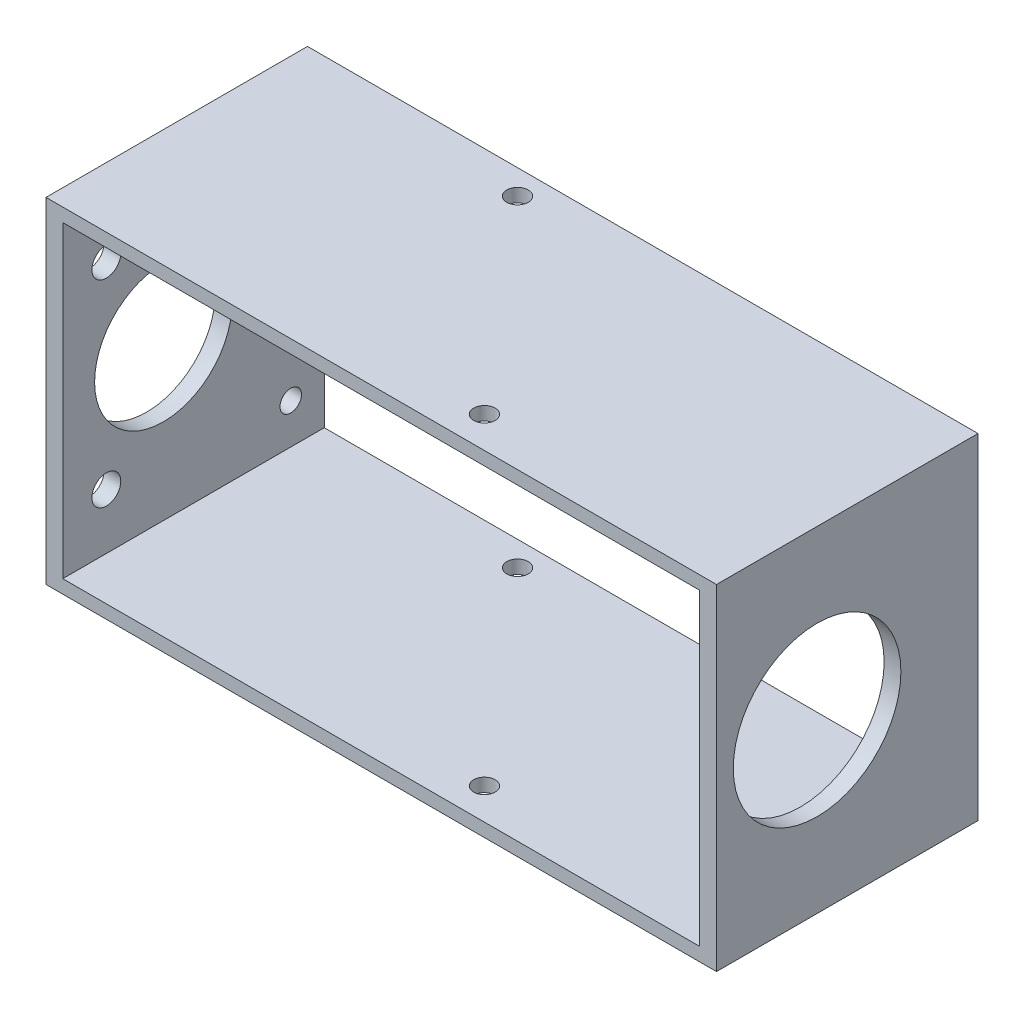
ISO-10303-21;
HEADER;
FILE_DESCRIPTION(('STEP AP214'),'2;1');
FILE_NAME('part.step','',(''),(''),'','','');
FILE_SCHEMA(('AUTOMOTIVE_DESIGN { 1 0 10303 214 1 1 1 1 }'));
ENDSEC;
DATA;
#1=APPLICATION_CONTEXT('core data for automotive mechanical design processes');
#2=APPLICATION_PROTOCOL_DEFINITION('international standard','automotive_design',2000,#1);
#3=PRODUCT_CONTEXT('',#1,'mechanical');
#4=PRODUCT('Part','Part','',(#3));
#5=PRODUCT_RELATED_PRODUCT_CATEGORY('part','',(#4));
#6=PRODUCT_DEFINITION_FORMATION('','',#4);
#7=PRODUCT_DEFINITION_CONTEXT('part definition',#1,'design');
#8=PRODUCT_DEFINITION('design','',#6,#7);
#9=PRODUCT_DEFINITION_SHAPE('','',#8);
#10=(LENGTH_UNIT() NAMED_UNIT(*) SI_UNIT(.MILLI.,.METRE.));
#11=(NAMED_UNIT(*) PLANE_ANGLE_UNIT() SI_UNIT($,.RADIAN.));
#12=(NAMED_UNIT(*) SI_UNIT($,.STERADIAN.) SOLID_ANGLE_UNIT());
#13=UNCERTAINTY_MEASURE_WITH_UNIT(LENGTH_MEASURE(1.E-05),#10,'distance_accuracy_value','');
#14=(GEOMETRIC_REPRESENTATION_CONTEXT(3) GLOBAL_UNCERTAINTY_ASSIGNED_CONTEXT((#13)) GLOBAL_UNIT_ASSIGNED_CONTEXT((#10,
#11,#12)) REPRESENTATION_CONTEXT('',''));
#15=CARTESIAN_POINT('',(0.,0.,0.));
#16=DIRECTION('',(0.,0.,1.));
#17=DIRECTION('',(1.,0.,0.));
#18=AXIS2_PLACEMENT_3D('',#15,#16,#17);
#19=CARTESIAN_POINT('',(0.,0.,19.5));
#20=DIRECTION('',(0.,0.,-1.));
#21=DIRECTION('',(-1.,0.,0.));
#22=AXIS2_PLACEMENT_3D('',#19,#20,#21);
#23=PLANE('',#22);
#24=DIRECTION('',(0.,1.,0.));
#25=VECTOR('',#24,1.);
#26=CARTESIAN_POINT('',(50.,-25.,19.5));
#27=LINE('',#26,#25);
#28=CARTESIAN_POINT('',(50.,-25.,19.5));
#29=VERTEX_POINT('',#28);
#30=CARTESIAN_POINT('',(50.,25.,19.5));
#31=VERTEX_POINT('',#30);
#32=EDGE_CURVE('E138',#29,#31,#27,.T.);
#33=ORIENTED_EDGE('',*,*,#32,.T.);
#34=DIRECTION('',(-1.,0.,0.));
#35=VECTOR('',#34,1.);
#36=CARTESIAN_POINT('',(-50.,25.,19.5));
#37=LINE('',#36,#35);
#38=CARTESIAN_POINT('',(-50.,25.,19.5));
#39=VERTEX_POINT('',#38);
#40=EDGE_CURVE('E141',#31,#39,#37,.T.);
#41=ORIENTED_EDGE('',*,*,#40,.T.);
#42=DIRECTION('',(0.,-1.,0.));
#43=VECTOR('',#42,1.);
#44=CARTESIAN_POINT('',(-50.,-25.,19.5));
#45=LINE('',#44,#43);
#46=CARTESIAN_POINT('',(-50.,-25.,19.5));
#47=VERTEX_POINT('',#46);
#48=EDGE_CURVE('E144',#39,#47,#45,.T.);
#49=ORIENTED_EDGE('',*,*,#48,.T.);
#50=DIRECTION('',(1.,0.,0.));
#51=VECTOR('',#50,1.);
#52=CARTESIAN_POINT('',(-50.,-25.,19.5));
#53=LINE('',#52,#51);
#54=EDGE_CURVE('E146',#47,#29,#53,.T.);
#55=ORIENTED_EDGE('',*,*,#54,.T.);
#56=EDGE_LOOP('',(#33,#41,#49,#55));
#57=FACE_BOUND('',#56,.T.);
#58=DIRECTION('',(0.,1.,0.));
#59=VECTOR('',#58,1.);
#60=CARTESIAN_POINT('',(47.5,-23.,19.5));
#61=LINE('',#60,#59);
#62=CARTESIAN_POINT('',(47.5,-23.,19.5));
#63=VERTEX_POINT('',#62);
#64=CARTESIAN_POINT('',(47.5,23.,19.5));
#65=VERTEX_POINT('',#64);
#66=EDGE_CURVE('E100',#63,#65,#61,.T.);
#67=ORIENTED_EDGE('',*,*,#66,.F.);
#68=DIRECTION('',(1.,0.,0.));
#69=VECTOR('',#68,1.);
#70=CARTESIAN_POINT('',(-47.5,-23.,19.5));
#71=LINE('',#70,#69);
#72=CARTESIAN_POINT('',(-47.5,-23.,19.5));
#73=VERTEX_POINT('',#72);
#74=EDGE_CURVE('E122',#73,#63,#71,.T.);
#75=ORIENTED_EDGE('',*,*,#74,.F.);
#76=DIRECTION('',(0.,-1.,0.));
#77=VECTOR('',#76,1.);
#78=CARTESIAN_POINT('',(-47.5,-23.,19.5));
#79=LINE('',#78,#77);
#80=CARTESIAN_POINT('',(-47.5,23.,19.5));
#81=VERTEX_POINT('',#80);
#82=EDGE_CURVE('E120',#81,#73,#79,.T.);
#83=ORIENTED_EDGE('',*,*,#82,.F.);
#84=DIRECTION('',(-1.,0.,0.));
#85=VECTOR('',#84,1.);
#86=CARTESIAN_POINT('',(-47.5,23.,19.5));
#87=LINE('',#86,#85);
#88=EDGE_CURVE('E108',#65,#81,#87,.T.);
#89=ORIENTED_EDGE('',*,*,#88,.F.);
#90=EDGE_LOOP('',(#67,#75,#83,#89));
#91=FACE_BOUND('',#90,.T.);
#92=ADVANCED_FACE('F33',(#57,#91),#23,.F.);
#93=CARTESIAN_POINT('',(0.,0.,-19.5));
#94=DIRECTION('',(0.,0.,-1.));
#95=DIRECTION('',(-1.,0.,0.));
#96=AXIS2_PLACEMENT_3D('',#93,#94,#95);
#97=PLANE('',#96);
#98=DIRECTION('',(0.,1.,0.));
#99=VECTOR('',#98,1.);
#100=CARTESIAN_POINT('',(50.,-25.,-19.5));
#101=LINE('',#100,#99);
#102=CARTESIAN_POINT('',(50.,-25.,-19.5));
#103=VERTEX_POINT('',#102);
#104=CARTESIAN_POINT('',(50.,25.,-19.5));
#105=VERTEX_POINT('',#104);
#106=EDGE_CURVE('E116',#103,#105,#101,.T.);
#107=ORIENTED_EDGE('',*,*,#106,.F.);
#108=DIRECTION('',(1.,0.,0.));
#109=VECTOR('',#108,1.);
#110=CARTESIAN_POINT('',(-50.,-25.,-19.5));
#111=LINE('',#110,#109);
#112=CARTESIAN_POINT('',(-50.,-25.,-19.5));
#113=VERTEX_POINT('',#112);
#114=EDGE_CURVE('E142',#113,#103,#111,.T.);
#115=ORIENTED_EDGE('',*,*,#114,.F.);
#116=DIRECTION('',(0.,-1.,0.));
#117=VECTOR('',#116,1.);
#118=CARTESIAN_POINT('',(-50.,-25.,-19.5));
#119=LINE('',#118,#117);
#120=CARTESIAN_POINT('',(-50.,25.,-19.5));
#121=VERTEX_POINT('',#120);
#122=EDGE_CURVE('E153',#121,#113,#119,.T.);
#123=ORIENTED_EDGE('',*,*,#122,.F.);
#124=DIRECTION('',(-1.,0.,0.));
#125=VECTOR('',#124,1.);
#126=CARTESIAN_POINT('',(-50.,25.,-19.5));
#127=LINE('',#126,#125);
#128=EDGE_CURVE('E151',#105,#121,#127,.T.);
#129=ORIENTED_EDGE('',*,*,#128,.F.);
#130=EDGE_LOOP('',(#107,#115,#123,#129));
#131=FACE_BOUND('',#130,.T.);
#132=DIRECTION('',(1.,0.,0.));
#133=VECTOR('',#132,1.);
#134=CARTESIAN_POINT('',(-47.5,-23.,-19.5));
#135=LINE('',#134,#133);
#136=CARTESIAN_POINT('',(-47.5,-23.,-19.5));
#137=VERTEX_POINT('',#136);
#138=CARTESIAN_POINT('',(47.5,-23.,-19.5));
#139=VERTEX_POINT('',#138);
#140=EDGE_CURVE('E109',#137,#139,#135,.T.);
#141=ORIENTED_EDGE('',*,*,#140,.T.);
#142=DIRECTION('',(0.,1.,0.));
#143=VECTOR('',#142,1.);
#144=CARTESIAN_POINT('',(47.5,-23.,-19.5));
#145=LINE('',#144,#143);
#146=CARTESIAN_POINT('',(47.5,23.,-19.5));
#147=VERTEX_POINT('',#146);
#148=EDGE_CURVE('E58',#139,#147,#145,.T.);
#149=ORIENTED_EDGE('',*,*,#148,.T.);
#150=DIRECTION('',(-1.,0.,0.));
#151=VECTOR('',#150,1.);
#152=CARTESIAN_POINT('',(-47.5,23.,-19.5));
#153=LINE('',#152,#151);
#154=CARTESIAN_POINT('',(-47.5,23.,-19.5));
#155=VERTEX_POINT('',#154);
#156=EDGE_CURVE('E115',#147,#155,#153,.T.);
#157=ORIENTED_EDGE('',*,*,#156,.T.);
#158=DIRECTION('',(0.,-1.,0.));
#159=VECTOR('',#158,1.);
#160=CARTESIAN_POINT('',(-47.5,-23.,-19.5));
#161=LINE('',#160,#159);
#162=EDGE_CURVE('E130',#155,#137,#161,.T.);
#163=ORIENTED_EDGE('',*,*,#162,.T.);
#164=EDGE_LOOP('',(#141,#149,#157,#163));
#165=FACE_BOUND('',#164,.T.);
#166=ADVANCED_FACE('F204',(#131,#165),#97,.T.);
#167=CARTESIAN_POINT('',(50.,-25.,19.5));
#168=DIRECTION('',(-1.,0.,0.));
#169=DIRECTION('',(0.,0.,1.));
#170=AXIS2_PLACEMENT_3D('',#167,#168,#169);
#171=PLANE('',#170);
#172=CARTESIAN_POINT('',(50.,0.,4.5));
#173=DIRECTION('',(1.,0.,0.));
#174=DIRECTION('',(0.,0.,-1.));
#175=AXIS2_PLACEMENT_3D('',#172,#173,#174);
#176=CIRCLE('',#175,12.5);
#177=CARTESIAN_POINT('',(50.,0.,-8.));
#178=VERTEX_POINT('',#177);
#179=EDGE_CURVE('E398',#178,#178,#176,.T.);
#180=ORIENTED_EDGE('',*,*,#179,.F.);
#181=EDGE_LOOP('',(#180));
#182=FACE_BOUND('',#181,.T.);
#183=ORIENTED_EDGE('',*,*,#106,.T.);
#184=DIRECTION('',(0.,0.,-1.));
#185=VECTOR('',#184,1.);
#186=CARTESIAN_POINT('',(50.,25.,19.5));
#187=LINE('',#186,#185);
#188=EDGE_CURVE('E11',#31,#105,#187,.T.);
#189=ORIENTED_EDGE('',*,*,#188,.F.);
#190=ORIENTED_EDGE('',*,*,#32,.F.);
#191=DIRECTION('',(0.,0.,-1.));
#192=VECTOR('',#191,1.);
#193=CARTESIAN_POINT('',(50.,-25.,19.5));
#194=LINE('',#193,#192);
#195=EDGE_CURVE('E148',#29,#103,#194,.T.);
#196=ORIENTED_EDGE('',*,*,#195,.T.);
#197=EDGE_LOOP('',(#183,#189,#190,#196));
#198=FACE_BOUND('',#197,.T.);
#199=ADVANCED_FACE('F35',(#182,#198),#171,.F.);
#200=CARTESIAN_POINT('',(-50.,25.,19.5));
#201=DIRECTION('',(0.,-1.,0.));
#202=DIRECTION('',(0.,0.,-1.));
#203=AXIS2_PLACEMENT_3D('',#200,#201,#202);
#204=PLANE('',#203);
#205=CARTESIAN_POINT('',(10.7115043874615,25.,14.8208888623796));
#206=DIRECTION('',(0.,1.,0.));
#207=DIRECTION('',(0.,0.,1.));
#208=AXIS2_PLACEMENT_3D('',#205,#206,#207);
#209=CIRCLE('',#208,1.6);
#210=CARTESIAN_POINT('',(10.7115043874615,25.,16.4208888623796));
#211=VERTEX_POINT('',#210);
#212=EDGE_CURVE('E171',#211,#211,#209,.T.);
#213=ORIENTED_EDGE('',*,*,#212,.F.);
#214=EDGE_LOOP('',(#213));
#215=FACE_BOUND('',#214,.T.);
#216=CARTESIAN_POINT('',(-15.,25.,-15.8208888623796));
#217=DIRECTION('',(0.,1.,0.));
#218=DIRECTION('',(0.,0.,1.));
#219=AXIS2_PLACEMENT_3D('',#216,#217,#218);
#220=CIRCLE('',#219,1.6);
#221=CARTESIAN_POINT('',(-15.,25.,-14.2208888623796));
#222=VERTEX_POINT('',#221);
#223=EDGE_CURVE('E184',#222,#222,#220,.T.);
#224=ORIENTED_EDGE('',*,*,#223,.F.);
#225=EDGE_LOOP('',(#224));
#226=FACE_BOUND('',#225,.T.);
#227=ORIENTED_EDGE('',*,*,#128,.T.);
#228=DIRECTION('',(0.,0.,-1.));
#229=VECTOR('',#228,1.);
#230=CARTESIAN_POINT('',(-50.,25.,19.5));
#231=LINE('',#230,#229);
#232=EDGE_CURVE('E42',#39,#121,#231,.T.);
#233=ORIENTED_EDGE('',*,*,#232,.F.);
#234=ORIENTED_EDGE('',*,*,#40,.F.);
#235=ORIENTED_EDGE('',*,*,#188,.T.);
#236=EDGE_LOOP('',(#227,#233,#234,#235));
#237=FACE_BOUND('',#236,.T.);
#238=ADVANCED_FACE('F231',(#215,#226,#237),#204,.F.);
#239=CARTESIAN_POINT('',(-50.,-25.,19.5));
#240=DIRECTION('',(1.,0.,0.));
#241=DIRECTION('',(0.,0.,-1.));
#242=AXIS2_PLACEMENT_3D('',#239,#240,#241);
#243=PLANE('',#242);
#244=CARTESIAN_POINT('',(-50.,0.,4.5));
#245=DIRECTION('',(-1.,0.,0.));
#246=DIRECTION('',(0.,0.,1.));
#247=AXIS2_PLACEMENT_3D('',#244,#245,#246);
#248=CIRCLE('',#247,10.25);
#249=CARTESIAN_POINT('',(-50.,0.,14.75));
#250=VERTEX_POINT('',#249);
#251=EDGE_CURVE('E409',#250,#250,#248,.T.);
#252=ORIENTED_EDGE('',*,*,#251,.F.);
#253=EDGE_LOOP('',(#252));
#254=FACE_BOUND('',#253,.T.);
#255=CARTESIAN_POINT('',(-50.,14.7224318643355,13.));
#256=DIRECTION('',(-1.,0.,0.));
#257=DIRECTION('',(0.,0.,1.));
#258=AXIS2_PLACEMENT_3D('',#255,#256,#257);
#259=CIRCLE('',#258,2.15);
#260=CARTESIAN_POINT('',(-50.,14.7224318643355,15.15));
#261=VERTEX_POINT('',#260);
#262=EDGE_CURVE('E414',#261,#261,#259,.T.);
#263=ORIENTED_EDGE('',*,*,#262,.F.);
#264=EDGE_LOOP('',(#263));
#265=FACE_BOUND('',#264,.T.);
#266=CARTESIAN_POINT('',(-50.,-14.7224318643355,13.));
#267=DIRECTION('',(-1.,0.,0.));
#268=DIRECTION('',(0.,0.,1.));
#269=AXIS2_PLACEMENT_3D('',#266,#267,#268);
#270=CIRCLE('',#269,2.15);
#271=CARTESIAN_POINT('',(-50.,-14.7224318643355,15.15));
#272=VERTEX_POINT('',#271);
#273=EDGE_CURVE('E420',#272,#272,#270,.T.);
#274=ORIENTED_EDGE('',*,*,#273,.F.);
#275=EDGE_LOOP('',(#274));
#276=FACE_BOUND('',#275,.T.);
#277=CARTESIAN_POINT('',(-50.,-17.,-14.5));
#278=DIRECTION('',(-1.,0.,0.));
#279=DIRECTION('',(0.,0.,1.));
#280=AXIS2_PLACEMENT_3D('',#277,#278,#279);
#281=CIRCLE('',#280,1.6);
#282=CARTESIAN_POINT('',(-50.,-17.,-12.9));
#283=VERTEX_POINT('',#282);
#284=EDGE_CURVE('E426',#283,#283,#281,.T.);
#285=ORIENTED_EDGE('',*,*,#284,.F.);
#286=EDGE_LOOP('',(#285));
#287=FACE_BOUND('',#286,.T.);
#288=CARTESIAN_POINT('',(-50.,17.,-14.5));
#289=DIRECTION('',(-1.,0.,0.));
#290=DIRECTION('',(0.,0.,1.));
#291=AXIS2_PLACEMENT_3D('',#288,#289,#290);
#292=CIRCLE('',#291,1.6);
#293=CARTESIAN_POINT('',(-50.,17.,-12.9));
#294=VERTEX_POINT('',#293);
#295=EDGE_CURVE('E402',#294,#294,#292,.T.);
#296=ORIENTED_EDGE('',*,*,#295,.F.);
#297=EDGE_LOOP('',(#296));
#298=FACE_BOUND('',#297,.T.);
#299=CARTESIAN_POINT('',(-50.,0.,-12.5));
#300=DIRECTION('',(-1.,0.,0.));
#301=DIRECTION('',(0.,0.,1.));
#302=AXIS2_PLACEMENT_3D('',#299,#300,#301);
#303=CIRCLE('',#302,2.15);
#304=CARTESIAN_POINT('',(-50.,0.,-10.35));
#305=VERTEX_POINT('',#304);
#306=EDGE_CURVE('E186',#305,#305,#303,.T.);
#307=ORIENTED_EDGE('',*,*,#306,.F.);
#308=EDGE_LOOP('',(#307));
#309=FACE_BOUND('',#308,.T.);
#310=ORIENTED_EDGE('',*,*,#122,.T.);
#311=DIRECTION('',(0.,0.,-1.));
#312=VECTOR('',#311,1.);
#313=CARTESIAN_POINT('',(-50.,-25.,19.5));
#314=LINE('',#313,#312);
#315=EDGE_CURVE('E158',#47,#113,#314,.T.);
#316=ORIENTED_EDGE('',*,*,#315,.F.);
#317=ORIENTED_EDGE('',*,*,#48,.F.);
#318=ORIENTED_EDGE('',*,*,#232,.T.);
#319=EDGE_LOOP('',(#310,#316,#317,#318));
#320=FACE_BOUND('',#319,.T.);
#321=ADVANCED_FACE('F229',(#254,#265,#276,#287,#298,#309,#320),#243,.F.);
#322=CARTESIAN_POINT('',(-50.,-25.,19.5));
#323=DIRECTION('',(0.,1.,0.));
#324=DIRECTION('',(0.,0.,1.));
#325=AXIS2_PLACEMENT_3D('',#322,#323,#324);
#326=PLANE('',#325);
#327=CARTESIAN_POINT('',(10.7115043874615,-25.,14.8208888623796));
#328=DIRECTION('',(0.,1.,0.));
#329=DIRECTION('',(0.,0.,1.));
#330=AXIS2_PLACEMENT_3D('',#327,#328,#329);
#331=CIRCLE('',#330,1.6);
#332=CARTESIAN_POINT('',(10.7115043874615,-25.,16.4208888623796));
#333=VERTEX_POINT('',#332);
#334=EDGE_CURVE('E165',#333,#333,#331,.T.);
#335=ORIENTED_EDGE('',*,*,#334,.T.);
#336=EDGE_LOOP('',(#335));
#337=FACE_BOUND('',#336,.T.);
#338=CARTESIAN_POINT('',(-15.,-25.,-15.8208888623796));
#339=DIRECTION('',(0.,1.,0.));
#340=DIRECTION('',(0.,0.,1.));
#341=AXIS2_PLACEMENT_3D('',#338,#339,#340);
#342=CIRCLE('',#341,1.6);
#343=CARTESIAN_POINT('',(-15.,-25.,-14.2208888623796));
#344=VERTEX_POINT('',#343);
#345=EDGE_CURVE('E176',#344,#344,#342,.T.);
#346=ORIENTED_EDGE('',*,*,#345,.T.);
#347=EDGE_LOOP('',(#346));
#348=FACE_BOUND('',#347,.T.);
#349=ORIENTED_EDGE('',*,*,#114,.T.);
#350=ORIENTED_EDGE('',*,*,#195,.F.);
#351=ORIENTED_EDGE('',*,*,#54,.F.);
#352=ORIENTED_EDGE('',*,*,#315,.T.);
#353=EDGE_LOOP('',(#349,#350,#351,#352));
#354=FACE_BOUND('',#353,.T.);
#355=ADVANCED_FACE('F226',(#337,#348,#354),#326,.F.);
#356=CARTESIAN_POINT('',(47.5,-23.,19.5));
#357=DIRECTION('',(-1.,0.,0.));
#358=DIRECTION('',(0.,0.,1.));
#359=AXIS2_PLACEMENT_3D('',#356,#357,#358);
#360=PLANE('',#359);
#361=CARTESIAN_POINT('',(47.5,0.,4.5));
#362=DIRECTION('',(-1.,0.,0.));
#363=DIRECTION('',(0.,0.,1.));
#364=AXIS2_PLACEMENT_3D('',#361,#362,#363);
#365=CIRCLE('',#364,12.5);
#366=CARTESIAN_POINT('',(47.5,0.,17.));
#367=VERTEX_POINT('',#366);
#368=EDGE_CURVE('E395',#367,#367,#365,.F.);
#369=ORIENTED_EDGE('',*,*,#368,.T.);
#370=EDGE_LOOP('',(#369));
#371=FACE_BOUND('',#370,.T.);
#372=ORIENTED_EDGE('',*,*,#148,.F.);
#373=DIRECTION('',(0.,0.,-1.));
#374=VECTOR('',#373,1.);
#375=CARTESIAN_POINT('',(47.5,-23.,19.5));
#376=LINE('',#375,#374);
#377=EDGE_CURVE('E104',#63,#139,#376,.T.);
#378=ORIENTED_EDGE('',*,*,#377,.F.);
#379=ORIENTED_EDGE('',*,*,#66,.T.);
#380=DIRECTION('',(0.,0.,-1.));
#381=VECTOR('',#380,1.);
#382=CARTESIAN_POINT('',(47.5,23.,19.5));
#383=LINE('',#382,#381);
#384=EDGE_CURVE('E103',#65,#147,#383,.T.);
#385=ORIENTED_EDGE('',*,*,#384,.T.);
#386=EDGE_LOOP('',(#372,#378,#379,#385));
#387=FACE_BOUND('',#386,.T.);
#388=ADVANCED_FACE('F102',(#371,#387),#360,.T.);
#389=CARTESIAN_POINT('',(-47.5,23.,19.5));
#390=DIRECTION('',(0.,-1.,0.));
#391=DIRECTION('',(0.,0.,-1.));
#392=AXIS2_PLACEMENT_3D('',#389,#390,#391);
#393=PLANE('',#392);
#394=CARTESIAN_POINT('',(10.7115043874615,23.,14.8208888623796));
#395=DIRECTION('',(0.,-1.,0.));
#396=DIRECTION('',(0.,0.,-1.));
#397=AXIS2_PLACEMENT_3D('',#394,#395,#396);
#398=CIRCLE('',#397,1.6);
#399=CARTESIAN_POINT('',(10.7115043874615,23.,13.2208888623796));
#400=VERTEX_POINT('',#399);
#401=EDGE_CURVE('E128',#400,#400,#398,.T.);
#402=ORIENTED_EDGE('',*,*,#401,.F.);
#403=EDGE_LOOP('',(#402));
#404=FACE_BOUND('',#403,.T.);
#405=CARTESIAN_POINT('',(-15.,23.,-15.8208888623796));
#406=DIRECTION('',(0.,-1.,0.));
#407=DIRECTION('',(0.,0.,-1.));
#408=AXIS2_PLACEMENT_3D('',#405,#406,#407);
#409=CIRCLE('',#408,1.6);
#410=CARTESIAN_POINT('',(-15.,23.,-17.4208888623796));
#411=VERTEX_POINT('',#410);
#412=EDGE_CURVE('E164',#411,#411,#409,.T.);
#413=ORIENTED_EDGE('',*,*,#412,.F.);
#414=EDGE_LOOP('',(#413));
#415=FACE_BOUND('',#414,.T.);
#416=ORIENTED_EDGE('',*,*,#156,.F.);
#417=ORIENTED_EDGE('',*,*,#384,.F.);
#418=ORIENTED_EDGE('',*,*,#88,.T.);
#419=DIRECTION('',(0.,0.,-1.));
#420=VECTOR('',#419,1.);
#421=CARTESIAN_POINT('',(-47.5,23.,19.5));
#422=LINE('',#421,#420);
#423=EDGE_CURVE('E117',#81,#155,#422,.T.);
#424=ORIENTED_EDGE('',*,*,#423,.T.);
#425=EDGE_LOOP('',(#416,#417,#418,#424));
#426=FACE_BOUND('',#425,.T.);
#427=ADVANCED_FACE('F112',(#404,#415,#426),#393,.T.);
#428=CARTESIAN_POINT('',(-47.5,-23.,19.5));
#429=DIRECTION('',(1.,0.,0.));
#430=DIRECTION('',(0.,0.,-1.));
#431=AXIS2_PLACEMENT_3D('',#428,#429,#430);
#432=PLANE('',#431);
#433=CARTESIAN_POINT('',(-47.5,0.,4.5));
#434=DIRECTION('',(1.,0.,0.));
#435=DIRECTION('',(0.,0.,-1.));
#436=AXIS2_PLACEMENT_3D('',#433,#434,#435);
#437=CIRCLE('',#436,10.25);
#438=CARTESIAN_POINT('',(-47.5,0.,-5.74999999999999));
#439=VERTEX_POINT('',#438);
#440=EDGE_CURVE('E412',#439,#439,#437,.F.);
#441=ORIENTED_EDGE('',*,*,#440,.T.);
#442=EDGE_LOOP('',(#441));
#443=FACE_BOUND('',#442,.T.);
#444=CARTESIAN_POINT('',(-47.5,14.7224318643355,13.));
#445=DIRECTION('',(1.,0.,0.));
#446=DIRECTION('',(0.,0.,-1.));
#447=AXIS2_PLACEMENT_3D('',#444,#445,#446);
#448=CIRCLE('',#447,2.15);
#449=CARTESIAN_POINT('',(-47.5,14.7224318643355,10.85));
#450=VERTEX_POINT('',#449);
#451=EDGE_CURVE('E417',#450,#450,#448,.F.);
#452=ORIENTED_EDGE('',*,*,#451,.T.);
#453=EDGE_LOOP('',(#452));
#454=FACE_BOUND('',#453,.T.);
#455=CARTESIAN_POINT('',(-47.5,-14.7224318643355,13.));
#456=DIRECTION('',(1.,0.,0.));
#457=DIRECTION('',(0.,0.,-1.));
#458=AXIS2_PLACEMENT_3D('',#455,#456,#457);
#459=CIRCLE('',#458,2.15);
#460=CARTESIAN_POINT('',(-47.5,-14.7224318643355,10.85));
#461=VERTEX_POINT('',#460);
#462=EDGE_CURVE('E423',#461,#461,#459,.F.);
#463=ORIENTED_EDGE('',*,*,#462,.T.);
#464=EDGE_LOOP('',(#463));
#465=FACE_BOUND('',#464,.T.);
#466=CARTESIAN_POINT('',(-47.5,-17.,-14.5));
#467=DIRECTION('',(1.,0.,0.));
#468=DIRECTION('',(0.,0.,-1.));
#469=AXIS2_PLACEMENT_3D('',#466,#467,#468);
#470=CIRCLE('',#469,1.6);
#471=CARTESIAN_POINT('',(-47.5,-17.,-16.1));
#472=VERTEX_POINT('',#471);
#473=EDGE_CURVE('E407',#472,#472,#470,.F.);
#474=ORIENTED_EDGE('',*,*,#473,.T.);
#475=EDGE_LOOP('',(#474));
#476=FACE_BOUND('',#475,.T.);
#477=CARTESIAN_POINT('',(-47.5,17.,-14.5));
#478=DIRECTION('',(1.,0.,0.));
#479=DIRECTION('',(0.,0.,-1.));
#480=AXIS2_PLACEMENT_3D('',#477,#478,#479);
#481=CIRCLE('',#480,1.6);
#482=CARTESIAN_POINT('',(-47.5,17.,-16.1));
#483=VERTEX_POINT('',#482);
#484=EDGE_CURVE('E399',#483,#483,#481,.F.);
#485=ORIENTED_EDGE('',*,*,#484,.T.);
#486=EDGE_LOOP('',(#485));
#487=FACE_BOUND('',#486,.T.);
#488=CARTESIAN_POINT('',(-47.5,0.,-12.5));
#489=DIRECTION('',(1.,0.,0.));
#490=DIRECTION('',(0.,0.,-1.));
#491=AXIS2_PLACEMENT_3D('',#488,#489,#490);
#492=CIRCLE('',#491,2.15);
#493=CARTESIAN_POINT('',(-47.5,0.,-14.65));
#494=VERTEX_POINT('',#493);
#495=EDGE_CURVE('E179',#494,#494,#492,.F.);
#496=ORIENTED_EDGE('',*,*,#495,.T.);
#497=EDGE_LOOP('',(#496));
#498=FACE_BOUND('',#497,.T.);
#499=ORIENTED_EDGE('',*,*,#162,.F.);
#500=ORIENTED_EDGE('',*,*,#423,.F.);
#501=ORIENTED_EDGE('',*,*,#82,.T.);
#502=DIRECTION('',(0.,0.,-1.));
#503=VECTOR('',#502,1.);
#504=CARTESIAN_POINT('',(-47.5,-23.,19.5));
#505=LINE('',#504,#503);
#506=EDGE_CURVE('E50',#73,#137,#505,.T.);
#507=ORIENTED_EDGE('',*,*,#506,.T.);
#508=EDGE_LOOP('',(#499,#500,#501,#507));
#509=FACE_BOUND('',#508,.T.);
#510=ADVANCED_FACE('F200',(#443,#454,#465,#476,#487,#498,#509),#432,.T.);
#511=CARTESIAN_POINT('',(-47.5,-23.,19.5));
#512=DIRECTION('',(0.,1.,0.));
#513=DIRECTION('',(0.,0.,1.));
#514=AXIS2_PLACEMENT_3D('',#511,#512,#513);
#515=PLANE('',#514);
#516=CARTESIAN_POINT('',(10.7115043874615,-23.,14.8208888623796));
#517=DIRECTION('',(0.,1.,0.));
#518=DIRECTION('',(0.,0.,1.));
#519=AXIS2_PLACEMENT_3D('',#516,#517,#518);
#520=CIRCLE('',#519,1.6);
#521=CARTESIAN_POINT('',(10.7115043874615,-23.,16.4208888623796));
#522=VERTEX_POINT('',#521);
#523=EDGE_CURVE('E37',#522,#522,#520,.T.);
#524=ORIENTED_EDGE('',*,*,#523,.F.);
#525=EDGE_LOOP('',(#524));
#526=FACE_BOUND('',#525,.T.);
#527=CARTESIAN_POINT('',(-15.,-23.,-15.8208888623796));
#528=DIRECTION('',(0.,1.,0.));
#529=DIRECTION('',(0.,0.,1.));
#530=AXIS2_PLACEMENT_3D('',#527,#528,#529);
#531=CIRCLE('',#530,1.6);
#532=CARTESIAN_POINT('',(-15.,-23.,-14.2208888623796));
#533=VERTEX_POINT('',#532);
#534=EDGE_CURVE('E162',#533,#533,#531,.T.);
#535=ORIENTED_EDGE('',*,*,#534,.F.);
#536=EDGE_LOOP('',(#535));
#537=FACE_BOUND('',#536,.T.);
#538=ORIENTED_EDGE('',*,*,#140,.F.);
#539=ORIENTED_EDGE('',*,*,#506,.F.);
#540=ORIENTED_EDGE('',*,*,#74,.T.);
#541=ORIENTED_EDGE('',*,*,#377,.T.);
#542=EDGE_LOOP('',(#538,#539,#540,#541));
#543=FACE_BOUND('',#542,.T.);
#544=ADVANCED_FACE('F196',(#526,#537,#543),#515,.T.);
#545=CARTESIAN_POINT('',(-15.,-25.,-15.8208888623796));
#546=DIRECTION('',(0.,1.,0.));
#547=DIRECTION('',(0.,0.,1.));
#548=AXIS2_PLACEMENT_3D('',#545,#546,#547);
#549=CYLINDRICAL_SURFACE('',#548,1.6);
#550=ORIENTED_EDGE('',*,*,#534,.T.);
#551=EDGE_LOOP('',(#550));
#552=FACE_BOUND('',#551,.T.);
#553=ORIENTED_EDGE('',*,*,#345,.F.);
#554=EDGE_LOOP('',(#553));
#555=FACE_BOUND('',#554,.T.);
#556=ADVANCED_FACE('F199',(#552,#555),#549,.F.);
#557=CARTESIAN_POINT('',(10.7115043874615,-25.,14.8208888623796));
#558=DIRECTION('',(0.,1.,0.));
#559=DIRECTION('',(0.,0.,1.));
#560=AXIS2_PLACEMENT_3D('',#557,#558,#559);
#561=CYLINDRICAL_SURFACE('',#560,1.6);
#562=ORIENTED_EDGE('',*,*,#523,.T.);
#563=EDGE_LOOP('',(#562));
#564=FACE_BOUND('',#563,.T.);
#565=ORIENTED_EDGE('',*,*,#334,.F.);
#566=EDGE_LOOP('',(#565));
#567=FACE_BOUND('',#566,.T.);
#568=ADVANCED_FACE('F193',(#564,#567),#561,.F.);
#569=ORIENTED_EDGE('',*,*,#412,.T.);
#570=EDGE_LOOP('',(#569));
#571=FACE_BOUND('',#570,.T.);
#572=ORIENTED_EDGE('',*,*,#223,.T.);
#573=EDGE_LOOP('',(#572));
#574=FACE_BOUND('',#573,.T.);
#575=ADVANCED_FACE('F257',(#571,#574),#549,.F.);
#576=ORIENTED_EDGE('',*,*,#401,.T.);
#577=EDGE_LOOP('',(#576));
#578=FACE_BOUND('',#577,.T.);
#579=ORIENTED_EDGE('',*,*,#212,.T.);
#580=EDGE_LOOP('',(#579));
#581=FACE_BOUND('',#580,.T.);
#582=ADVANCED_FACE('F259',(#578,#581),#561,.F.);
#583=CARTESIAN_POINT('',(50.001,0.,-12.5));
#584=DIRECTION('',(-1.,0.,0.));
#585=DIRECTION('',(0.,0.,1.));
#586=AXIS2_PLACEMENT_3D('',#583,#584,#585);
#587=CYLINDRICAL_SURFACE('',#586,2.15);
#588=ORIENTED_EDGE('',*,*,#495,.F.);
#589=EDGE_LOOP('',(#588));
#590=FACE_BOUND('',#589,.T.);
#591=ORIENTED_EDGE('',*,*,#306,.T.);
#592=EDGE_LOOP('',(#591));
#593=FACE_BOUND('',#592,.T.);
#594=ADVANCED_FACE('F266',(#590,#593),#587,.F.);
#595=CARTESIAN_POINT('',(50.001,17.,-14.5));
#596=DIRECTION('',(-1.,0.,0.));
#597=DIRECTION('',(0.,0.,1.));
#598=AXIS2_PLACEMENT_3D('',#595,#596,#597);
#599=CYLINDRICAL_SURFACE('',#598,1.6);
#600=ORIENTED_EDGE('',*,*,#484,.F.);
#601=EDGE_LOOP('',(#600));
#602=FACE_BOUND('',#601,.T.);
#603=ORIENTED_EDGE('',*,*,#295,.T.);
#604=EDGE_LOOP('',(#603));
#605=FACE_BOUND('',#604,.T.);
#606=ADVANCED_FACE('F313',(#602,#605),#599,.F.);
#607=CARTESIAN_POINT('',(50.001,-17.,-14.5));
#608=DIRECTION('',(-1.,0.,0.));
#609=DIRECTION('',(0.,0.,1.));
#610=AXIS2_PLACEMENT_3D('',#607,#608,#609);
#611=CYLINDRICAL_SURFACE('',#610,1.6);
#612=ORIENTED_EDGE('',*,*,#473,.F.);
#613=EDGE_LOOP('',(#612));
#614=FACE_BOUND('',#613,.T.);
#615=ORIENTED_EDGE('',*,*,#284,.T.);
#616=EDGE_LOOP('',(#615));
#617=FACE_BOUND('',#616,.T.);
#618=ADVANCED_FACE('F323',(#614,#617),#611,.F.);
#619=CARTESIAN_POINT('',(50.001,-14.7224318643355,13.));
#620=DIRECTION('',(-1.,0.,0.));
#621=DIRECTION('',(0.,0.,1.));
#622=AXIS2_PLACEMENT_3D('',#619,#620,#621);
#623=CYLINDRICAL_SURFACE('',#622,2.15);
#624=ORIENTED_EDGE('',*,*,#462,.F.);
#625=EDGE_LOOP('',(#624));
#626=FACE_BOUND('',#625,.T.);
#627=ORIENTED_EDGE('',*,*,#273,.T.);
#628=EDGE_LOOP('',(#627));
#629=FACE_BOUND('',#628,.T.);
#630=ADVANCED_FACE('F333',(#626,#629),#623,.F.);
#631=CARTESIAN_POINT('',(50.001,14.7224318643355,13.));
#632=DIRECTION('',(-1.,0.,0.));
#633=DIRECTION('',(0.,0.,1.));
#634=AXIS2_PLACEMENT_3D('',#631,#632,#633);
#635=CYLINDRICAL_SURFACE('',#634,2.15);
#636=ORIENTED_EDGE('',*,*,#451,.F.);
#637=EDGE_LOOP('',(#636));
#638=FACE_BOUND('',#637,.T.);
#639=ORIENTED_EDGE('',*,*,#262,.T.);
#640=EDGE_LOOP('',(#639));
#641=FACE_BOUND('',#640,.T.);
#642=ADVANCED_FACE('F343',(#638,#641),#635,.F.);
#643=CARTESIAN_POINT('',(50.001,0.,4.5));
#644=DIRECTION('',(-1.,0.,0.));
#645=DIRECTION('',(0.,0.,1.));
#646=AXIS2_PLACEMENT_3D('',#643,#644,#645);
#647=CYLINDRICAL_SURFACE('',#646,10.25);
#648=ORIENTED_EDGE('',*,*,#440,.F.);
#649=EDGE_LOOP('',(#648));
#650=FACE_BOUND('',#649,.T.);
#651=ORIENTED_EDGE('',*,*,#251,.T.);
#652=EDGE_LOOP('',(#651));
#653=FACE_BOUND('',#652,.T.);
#654=ADVANCED_FACE('F353',(#650,#653),#647,.F.);
#655=CARTESIAN_POINT('',(-50.001,0.,4.5));
#656=DIRECTION('',(1.,0.,0.));
#657=DIRECTION('',(0.,0.,-1.));
#658=AXIS2_PLACEMENT_3D('',#655,#656,#657);
#659=CYLINDRICAL_SURFACE('',#658,12.5);
#660=ORIENTED_EDGE('',*,*,#368,.F.);
#661=EDGE_LOOP('',(#660));
#662=FACE_BOUND('',#661,.T.);
#663=ORIENTED_EDGE('',*,*,#179,.T.);
#664=EDGE_LOOP('',(#663));
#665=FACE_BOUND('',#664,.T.);
#666=ADVANCED_FACE('F363',(#662,#665),#659,.F.);
#667=CLOSED_SHELL('',(#92,#166,#199,#238,#321,#355,#388,#427,#510,#544,#556,#568,#575,#582,#594,
#606,#618,#630,#642,#654,#666));
#668=MANIFOLD_SOLID_BREP('B2',#667);
#669=ADVANCED_BREP_SHAPE_REPRESENTATION('',(#18,#668),#14);
#670=SHAPE_DEFINITION_REPRESENTATION(#9,#669);
ENDSEC;
END-ISO-10303-21;
